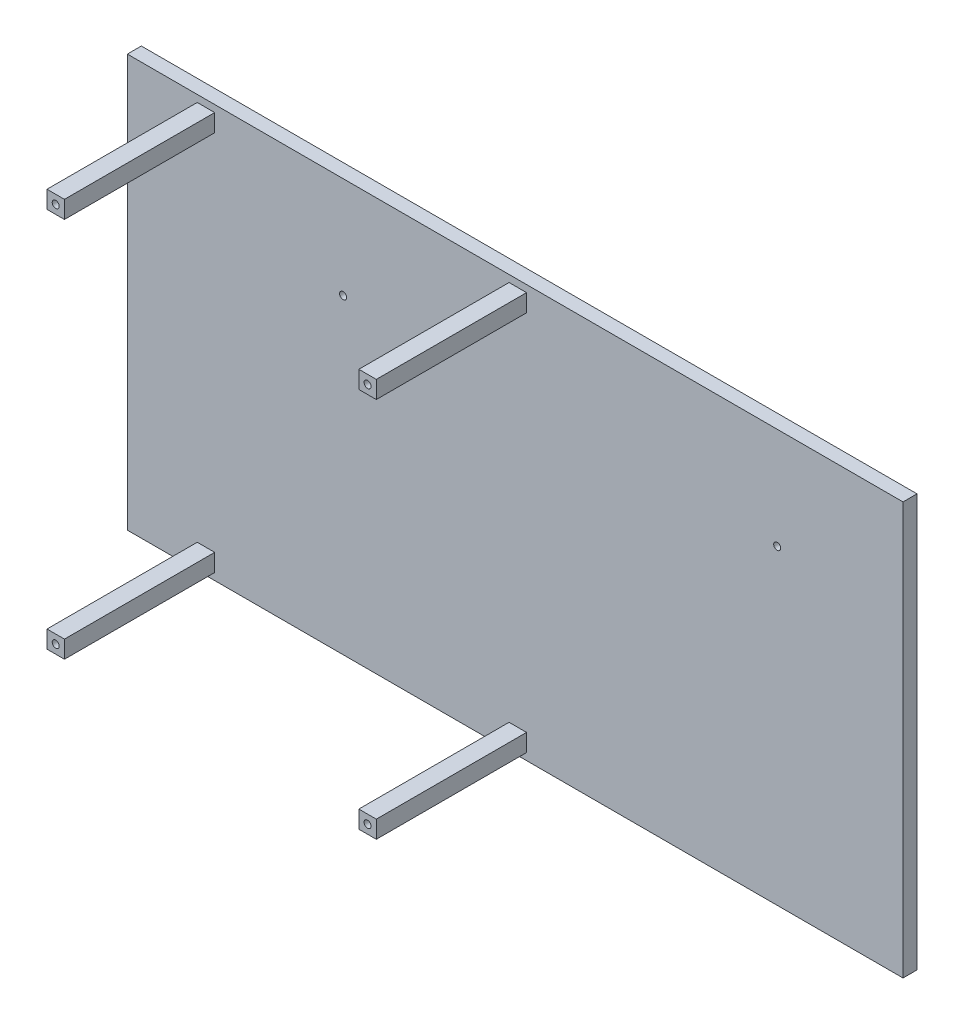
ISO-10303-21;
HEADER;
FILE_DESCRIPTION(('STEP AP214'),'2;1');
FILE_NAME('part.step','',(''),(''),'','','');
FILE_SCHEMA(('AUTOMOTIVE_DESIGN { 1 0 10303 214 1 1 1 1 }'));
ENDSEC;
DATA;
#1=APPLICATION_CONTEXT('core data for automotive mechanical design processes');
#2=APPLICATION_PROTOCOL_DEFINITION('international standard','automotive_design',2000,#1);
#3=PRODUCT_CONTEXT('',#1,'mechanical');
#4=PRODUCT('Part','Part','',(#3));
#5=PRODUCT_RELATED_PRODUCT_CATEGORY('part','',(#4));
#6=PRODUCT_DEFINITION_FORMATION('','',#4);
#7=PRODUCT_DEFINITION_CONTEXT('part definition',#1,'design');
#8=PRODUCT_DEFINITION('design','',#6,#7);
#9=PRODUCT_DEFINITION_SHAPE('','',#8);
#10=(LENGTH_UNIT() NAMED_UNIT(*) SI_UNIT(.MILLI.,.METRE.));
#11=(NAMED_UNIT(*) PLANE_ANGLE_UNIT() SI_UNIT($,.RADIAN.));
#12=(NAMED_UNIT(*) SI_UNIT($,.STERADIAN.) SOLID_ANGLE_UNIT());
#13=UNCERTAINTY_MEASURE_WITH_UNIT(LENGTH_MEASURE(1.E-05),#10,'distance_accuracy_value','');
#14=(GEOMETRIC_REPRESENTATION_CONTEXT(3) GLOBAL_UNCERTAINTY_ASSIGNED_CONTEXT((#13)) GLOBAL_UNIT_ASSIGNED_CONTEXT((#10,
#11,#12)) REPRESENTATION_CONTEXT('',''));
#15=CARTESIAN_POINT('',(0.,0.,0.));
#16=DIRECTION('',(0.,0.,1.));
#17=DIRECTION('',(1.,0.,0.));
#18=AXIS2_PLACEMENT_3D('',#15,#16,#17);
#19=CARTESIAN_POINT('',(0.,0.,4.));
#20=DIRECTION('',(0.,0.,1.));
#21=DIRECTION('',(1.,0.,0.));
#22=AXIS2_PLACEMENT_3D('',#19,#20,#21);
#23=PLANE('',#22);
#24=DIRECTION('',(-1.,0.,0.));
#25=VECTOR('',#24,1.);
#26=CARTESIAN_POINT('',(-69.7767857142857,-104.441964285714,4.));
#27=LINE('',#26,#25);
#28=CARTESIAN_POINT('',(150.223214285714,-104.441964285714,4.));
#29=VERTEX_POINT('',#28);
#30=CARTESIAN_POINT('',(-71.7767857142857,-104.441964285714,4.));
#31=VERTEX_POINT('',#30);
#32=EDGE_CURVE('E326',#29,#31,#27,.T.);
#33=ORIENTED_EDGE('',*,*,#32,.F.);
#34=DIRECTION('',(0.,-1.,0.));
#35=VECTOR('',#34,1.);
#36=CARTESIAN_POINT('',(150.223214285714,38.0580357142857,4.));
#37=LINE('',#36,#35);
#38=CARTESIAN_POINT('',(150.223214285714,13.5580357142857,4.));
#39=VERTEX_POINT('',#38);
#40=EDGE_CURVE('E390',#39,#29,#37,.T.);
#41=ORIENTED_EDGE('',*,*,#40,.F.);
#42=DIRECTION('',(1.,0.,0.));
#43=VECTOR('',#42,1.);
#44=CARTESIAN_POINT('',(-69.7767857142857,13.5580357142857,4.));
#45=LINE('',#44,#43);
#46=CARTESIAN_POINT('',(-71.7767857142857,13.5580357142857,4.));
#47=VERTEX_POINT('',#46);
#48=EDGE_CURVE('E333',#47,#39,#45,.T.);
#49=ORIENTED_EDGE('',*,*,#48,.F.);
#50=DIRECTION('',(0.,-1.,0.));
#51=VECTOR('',#50,1.);
#52=CARTESIAN_POINT('',(-71.7767857142857,13.5580357142857,4.));
#53=LINE('',#52,#51);
#54=EDGE_CURVE('E262',#47,#31,#53,.T.);
#55=ORIENTED_EDGE('',*,*,#54,.T.);
#56=EDGE_LOOP('',(#33,#41,#49,#55));
#57=FACE_BOUND('',#56,.T.);
#58=CARTESIAN_POINT('',(-10.0267857142857,-15.4419642857143,4.));
#59=DIRECTION('',(0.,0.,1.));
#60=DIRECTION('',(1.,0.,0.));
#61=AXIS2_PLACEMENT_3D('',#58,#59,#60);
#62=CIRCLE('',#61,0.999999999999998);
#63=CARTESIAN_POINT('',(-9.02678571428567,-15.4419642857143,4.));
#64=VERTEX_POINT('',#63);
#65=EDGE_CURVE('E395',#64,#64,#62,.T.);
#66=ORIENTED_EDGE('',*,*,#65,.F.);
#67=EDGE_LOOP('',(#66));
#68=FACE_BOUND('',#67,.T.);
#69=CARTESIAN_POINT('',(114.203214285714,-15.4419642857143,4.));
#70=DIRECTION('',(0.,0.,1.));
#71=DIRECTION('',(1.,0.,0.));
#72=AXIS2_PLACEMENT_3D('',#69,#70,#71);
#73=CIRCLE('',#72,0.999999999999998);
#74=CARTESIAN_POINT('',(115.203214285714,-15.4419642857143,4.));
#75=VERTEX_POINT('',#74);
#76=EDGE_CURVE('E391',#75,#75,#73,.T.);
#77=ORIENTED_EDGE('',*,*,#76,.F.);
#78=EDGE_LOOP('',(#77));
#79=FACE_BOUND('',#78,.T.);
#80=DIRECTION('',(-1.,0.,0.));
#81=VECTOR('',#80,1.);
#82=CARTESIAN_POINT('',(37.4732142857143,11.5580357142857,4.));
#83=LINE('',#82,#81);
#84=CARTESIAN_POINT('',(42.4732142857143,11.5580357142857,4.));
#85=VERTEX_POINT('',#84);
#86=CARTESIAN_POINT('',(37.4732142857143,11.5580357142857,4.));
#87=VERTEX_POINT('',#86);
#88=EDGE_CURVE('E363',#85,#87,#83,.T.);
#89=ORIENTED_EDGE('',*,*,#88,.F.);
#90=DIRECTION('',(0.,1.,0.));
#91=VECTOR('',#90,1.);
#92=CARTESIAN_POINT('',(42.4732142857143,11.5580357142857,4.));
#93=LINE('',#92,#91);
#94=CARTESIAN_POINT('',(42.4732142857143,6.55803571428572,4.));
#95=VERTEX_POINT('',#94);
#96=EDGE_CURVE('E344',#95,#85,#93,.T.);
#97=ORIENTED_EDGE('',*,*,#96,.F.);
#98=DIRECTION('',(1.,0.,0.));
#99=VECTOR('',#98,1.);
#100=CARTESIAN_POINT('',(37.4732142857143,6.55803571428572,4.));
#101=LINE('',#100,#99);
#102=CARTESIAN_POINT('',(37.4732142857143,6.55803571428572,4.));
#103=VERTEX_POINT('',#102);
#104=EDGE_CURVE('E350',#103,#95,#101,.T.);
#105=ORIENTED_EDGE('',*,*,#104,.F.);
#106=DIRECTION('',(0.,-1.,0.));
#107=VECTOR('',#106,1.);
#108=CARTESIAN_POINT('',(37.4732142857143,11.5580357142857,4.));
#109=LINE('',#108,#107);
#110=EDGE_CURVE('E366',#87,#103,#109,.T.);
#111=ORIENTED_EDGE('',*,*,#110,.F.);
#112=EDGE_LOOP('',(#89,#97,#105,#111));
#113=FACE_BOUND('',#112,.T.);
#114=DIRECTION('',(-1.,0.,0.));
#115=VECTOR('',#114,1.);
#116=CARTESIAN_POINT('',(42.4732142857143,-97.4419642857143,4.));
#117=LINE('',#116,#115);
#118=CARTESIAN_POINT('',(42.4732142857143,-97.4419642857143,4.));
#119=VERTEX_POINT('',#118);
#120=CARTESIAN_POINT('',(37.4732142857143,-97.4419642857143,4.));
#121=VERTEX_POINT('',#120);
#122=EDGE_CURVE('E301',#119,#121,#117,.T.);
#123=ORIENTED_EDGE('',*,*,#122,.F.);
#124=DIRECTION('',(0.,1.,0.));
#125=VECTOR('',#124,1.);
#126=CARTESIAN_POINT('',(42.4732142857143,-102.441964285714,4.));
#127=LINE('',#126,#125);
#128=CARTESIAN_POINT('',(42.4732142857143,-102.441964285714,4.));
#129=VERTEX_POINT('',#128);
#130=EDGE_CURVE('E279',#129,#119,#127,.T.);
#131=ORIENTED_EDGE('',*,*,#130,.F.);
#132=DIRECTION('',(1.,0.,0.));
#133=VECTOR('',#132,1.);
#134=CARTESIAN_POINT('',(42.4732142857143,-102.441964285714,4.));
#135=LINE('',#134,#133);
#136=CARTESIAN_POINT('',(37.4732142857143,-102.441964285714,4.));
#137=VERTEX_POINT('',#136);
#138=EDGE_CURVE('E288',#137,#129,#135,.T.);
#139=ORIENTED_EDGE('',*,*,#138,.F.);
#140=DIRECTION('',(0.,-1.,0.));
#141=VECTOR('',#140,1.);
#142=CARTESIAN_POINT('',(37.4732142857143,-102.441964285714,4.));
#143=LINE('',#142,#141);
#144=EDGE_CURVE('E304',#121,#137,#143,.T.);
#145=ORIENTED_EDGE('',*,*,#144,.F.);
#146=EDGE_LOOP('',(#123,#131,#139,#145));
#147=FACE_BOUND('',#146,.T.);
#148=DIRECTION('',(1.,0.,0.));
#149=VECTOR('',#148,1.);
#150=CARTESIAN_POINT('',(-46.7767857142857,6.55803571428572,4.));
#151=LINE('',#150,#149);
#152=CARTESIAN_POINT('',(-51.7767857142857,6.55803571428572,4.));
#153=VERTEX_POINT('',#152);
#154=CARTESIAN_POINT('',(-46.7767857142857,6.55803571428572,4.));
#155=VERTEX_POINT('',#154);
#156=EDGE_CURVE('E213',#153,#155,#151,.T.);
#157=ORIENTED_EDGE('',*,*,#156,.F.);
#158=DIRECTION('',(0.,-1.,0.));
#159=VECTOR('',#158,1.);
#160=CARTESIAN_POINT('',(-51.7767857142857,11.5580357142857,4.));
#161=LINE('',#160,#159);
#162=CARTESIAN_POINT('',(-51.7767857142857,11.5580357142857,4.));
#163=VERTEX_POINT('',#162);
#164=EDGE_CURVE('E208',#163,#153,#161,.T.);
#165=ORIENTED_EDGE('',*,*,#164,.F.);
#166=DIRECTION('',(-1.,0.,0.));
#167=VECTOR('',#166,1.);
#168=CARTESIAN_POINT('',(-46.7767857142857,11.5580357142857,4.));
#169=LINE('',#168,#167);
#170=CARTESIAN_POINT('',(-46.7767857142857,11.5580357142857,4.));
#171=VERTEX_POINT('',#170);
#172=EDGE_CURVE('E233',#171,#163,#169,.T.);
#173=ORIENTED_EDGE('',*,*,#172,.F.);
#174=DIRECTION('',(0.,1.,0.));
#175=VECTOR('',#174,1.);
#176=CARTESIAN_POINT('',(-46.7767857142857,11.5580357142857,4.));
#177=LINE('',#176,#175);
#178=EDGE_CURVE('E245',#155,#171,#177,.T.);
#179=ORIENTED_EDGE('',*,*,#178,.F.);
#180=EDGE_LOOP('',(#157,#165,#173,#179));
#181=FACE_BOUND('',#180,.T.);
#182=DIRECTION('',(1.,0.,0.));
#183=VECTOR('',#182,1.);
#184=CARTESIAN_POINT('',(-51.7767857142857,-102.441964285714,4.));
#185=LINE('',#184,#183);
#186=CARTESIAN_POINT('',(-51.7767857142857,-102.441964285714,4.));
#187=VERTEX_POINT('',#186);
#188=CARTESIAN_POINT('',(-46.7767857142857,-102.441964285714,4.));
#189=VERTEX_POINT('',#188);
#190=EDGE_CURVE('E206',#187,#189,#185,.T.);
#191=ORIENTED_EDGE('',*,*,#190,.F.);
#192=DIRECTION('',(0.,-1.,0.));
#193=VECTOR('',#192,1.);
#194=CARTESIAN_POINT('',(-51.7767857142857,-97.4419642857143,4.));
#195=LINE('',#194,#193);
#196=CARTESIAN_POINT('',(-51.7767857142857,-97.4419642857143,4.));
#197=VERTEX_POINT('',#196);
#198=EDGE_CURVE('E200',#197,#187,#195,.T.);
#199=ORIENTED_EDGE('',*,*,#198,.F.);
#200=DIRECTION('',(-1.,0.,0.));
#201=VECTOR('',#200,1.);
#202=CARTESIAN_POINT('',(-51.7767857142857,-97.4419642857143,4.));
#203=LINE('',#202,#201);
#204=CARTESIAN_POINT('',(-46.7767857142857,-97.4419642857143,4.));
#205=VERTEX_POINT('',#204);
#206=EDGE_CURVE('E184',#205,#197,#203,.T.);
#207=ORIENTED_EDGE('',*,*,#206,.F.);
#208=DIRECTION('',(0.,1.,0.));
#209=VECTOR('',#208,1.);
#210=CARTESIAN_POINT('',(-46.7767857142857,-97.4419642857143,4.));
#211=LINE('',#210,#209);
#212=EDGE_CURVE('E193',#189,#205,#211,.T.);
#213=ORIENTED_EDGE('',*,*,#212,.F.);
#214=EDGE_LOOP('',(#191,#199,#207,#213));
#215=FACE_BOUND('',#214,.T.);
#216=ADVANCED_FACE('F45',(#57,#68,#79,#113,#147,#181,#215),#23,.T.);
#217=CARTESIAN_POINT('',(-69.7767857142857,-104.441964285714,0.));
#218=DIRECTION('',(0.,-1.,0.));
#219=DIRECTION('',(0.,0.,-1.));
#220=AXIS2_PLACEMENT_3D('',#217,#218,#219);
#221=PLANE('',#220);
#222=ORIENTED_EDGE('',*,*,#32,.T.);
#223=DIRECTION('',(0.,0.,1.));
#224=VECTOR('',#223,1.);
#225=CARTESIAN_POINT('',(-71.7767857142857,-104.441964285714,0.));
#226=LINE('',#225,#224);
#227=CARTESIAN_POINT('',(-71.7767857142857,-104.441964285714,0.));
#228=VERTEX_POINT('',#227);
#229=EDGE_CURVE('E11',#228,#31,#226,.T.);
#230=ORIENTED_EDGE('',*,*,#229,.F.);
#231=DIRECTION('',(1.,0.,0.));
#232=VECTOR('',#231,1.);
#233=CARTESIAN_POINT('',(-69.7767857142857,-104.441964285714,0.));
#234=LINE('',#233,#232);
#235=CARTESIAN_POINT('',(150.223214285714,-104.441964285714,0.));
#236=VERTEX_POINT('',#235);
#237=EDGE_CURVE('E54',#228,#236,#234,.T.);
#238=ORIENTED_EDGE('',*,*,#237,.T.);
#239=DIRECTION('',(0.,0.,1.));
#240=VECTOR('',#239,1.);
#241=CARTESIAN_POINT('',(150.223214285714,-104.441964285714,-6.));
#242=LINE('',#241,#240);
#243=EDGE_CURVE('E329',#236,#29,#242,.T.);
#244=ORIENTED_EDGE('',*,*,#243,.T.);
#245=EDGE_LOOP('',(#222,#230,#238,#244));
#246=FACE_BOUND('',#245,.T.);
#247=ADVANCED_FACE('F414',(#246),#221,.T.);
#248=CARTESIAN_POINT('',(-71.7767857142857,-104.441964285714,0.));
#249=DIRECTION('',(-1.,0.,0.));
#250=DIRECTION('',(0.,0.,1.));
#251=AXIS2_PLACEMENT_3D('',#248,#249,#250);
#252=PLANE('',#251);
#253=ORIENTED_EDGE('',*,*,#229,.T.);
#254=ORIENTED_EDGE('',*,*,#54,.F.);
#255=DIRECTION('',(0.,0.,-1.));
#256=VECTOR('',#255,1.);
#257=CARTESIAN_POINT('',(-71.7767857142857,13.5580357142857,47.));
#258=LINE('',#257,#256);
#259=CARTESIAN_POINT('',(-71.7767857142857,13.5580357142857,0.));
#260=VERTEX_POINT('',#259);
#261=EDGE_CURVE('E323',#47,#260,#258,.T.);
#262=ORIENTED_EDGE('',*,*,#261,.T.);
#263=DIRECTION('',(0.,-1.,0.));
#264=VECTOR('',#263,1.);
#265=CARTESIAN_POINT('',(-71.7767857142857,-104.441964285714,0.));
#266=LINE('',#265,#264);
#267=EDGE_CURVE('E407',#260,#228,#266,.T.);
#268=ORIENTED_EDGE('',*,*,#267,.T.);
#269=EDGE_LOOP('',(#253,#254,#262,#268));
#270=FACE_BOUND('',#269,.T.);
#271=ADVANCED_FACE('F47',(#270),#252,.T.);
#272=CARTESIAN_POINT('',(-69.7767857142857,13.5580357142857,-6.));
#273=DIRECTION('',(0.,-1.,0.));
#274=DIRECTION('',(0.,0.,-1.));
#275=AXIS2_PLACEMENT_3D('',#272,#273,#274);
#276=PLANE('',#275);
#277=ORIENTED_EDGE('',*,*,#261,.F.);
#278=ORIENTED_EDGE('',*,*,#48,.T.);
#279=DIRECTION('',(0.,0.,1.));
#280=VECTOR('',#279,1.);
#281=CARTESIAN_POINT('',(150.223214285714,13.5580357142857,-6.));
#282=LINE('',#281,#280);
#283=CARTESIAN_POINT('',(150.223214285714,13.5580357142857,0.));
#284=VERTEX_POINT('',#283);
#285=EDGE_CURVE('E336',#284,#39,#282,.T.);
#286=ORIENTED_EDGE('',*,*,#285,.F.);
#287=DIRECTION('',(1.,0.,0.));
#288=VECTOR('',#287,1.);
#289=CARTESIAN_POINT('',(0.,13.5580357142857,0.));
#290=LINE('',#289,#288);
#291=EDGE_CURVE('E340',#260,#284,#290,.T.);
#292=ORIENTED_EDGE('',*,*,#291,.F.);
#293=EDGE_LOOP('',(#277,#278,#286,#292));
#294=FACE_BOUND('',#293,.T.);
#295=ADVANCED_FACE('F428',(#294),#276,.F.);
#296=CARTESIAN_POINT('',(0.,0.,0.));
#297=DIRECTION('',(0.,0.,1.));
#298=DIRECTION('',(1.,0.,0.));
#299=AXIS2_PLACEMENT_3D('',#296,#297,#298);
#300=PLANE('',#299);
#301=ORIENTED_EDGE('',*,*,#291,.T.);
#302=DIRECTION('',(0.,1.,0.));
#303=VECTOR('',#302,1.);
#304=CARTESIAN_POINT('',(150.223214285714,38.0580357142857,0.));
#305=LINE('',#304,#303);
#306=EDGE_CURVE('E404',#236,#284,#305,.T.);
#307=ORIENTED_EDGE('',*,*,#306,.F.);
#308=ORIENTED_EDGE('',*,*,#237,.F.);
#309=ORIENTED_EDGE('',*,*,#267,.F.);
#310=EDGE_LOOP('',(#301,#307,#308,#309));
#311=FACE_BOUND('',#310,.T.);
#312=CARTESIAN_POINT('',(114.203214285714,-15.4419642857143,0.));
#313=DIRECTION('',(0.,0.,1.));
#314=DIRECTION('',(1.,0.,0.));
#315=AXIS2_PLACEMENT_3D('',#312,#313,#314);
#316=CIRCLE('',#315,0.999999999999998);
#317=CARTESIAN_POINT('',(115.203214285714,-15.4419642857143,0.));
#318=VERTEX_POINT('',#317);
#319=EDGE_CURVE('E386',#318,#318,#316,.T.);
#320=ORIENTED_EDGE('',*,*,#319,.T.);
#321=EDGE_LOOP('',(#320));
#322=FACE_BOUND('',#321,.T.);
#323=CARTESIAN_POINT('',(-10.0267857142857,-15.4419642857143,0.));
#324=DIRECTION('',(0.,0.,1.));
#325=DIRECTION('',(1.,0.,0.));
#326=AXIS2_PLACEMENT_3D('',#323,#324,#325);
#327=CIRCLE('',#326,0.999999999999998);
#328=CARTESIAN_POINT('',(-9.02678571428567,-15.4419642857143,0.));
#329=VERTEX_POINT('',#328);
#330=EDGE_CURVE('E385',#329,#329,#327,.T.);
#331=ORIENTED_EDGE('',*,*,#330,.T.);
#332=EDGE_LOOP('',(#331));
#333=FACE_BOUND('',#332,.T.);
#334=ADVANCED_FACE('F423',(#311,#322,#333),#300,.F.);
#335=CARTESIAN_POINT('',(0.,0.,47.));
#336=DIRECTION('',(0.,0.,1.));
#337=DIRECTION('',(1.,0.,0.));
#338=AXIS2_PLACEMENT_3D('',#335,#336,#337);
#339=PLANE('',#338);
#340=CARTESIAN_POINT('',(39.9732142857143,-99.9419642857143,47.));
#341=DIRECTION('',(0.,0.,1.));
#342=DIRECTION('',(1.,0.,0.));
#343=AXIS2_PLACEMENT_3D('',#340,#341,#342);
#344=CIRCLE('',#343,0.999999999999998);
#345=CARTESIAN_POINT('',(40.9732142857143,-99.9419642857143,47.));
#346=VERTEX_POINT('',#345);
#347=EDGE_CURVE('E267',#346,#346,#344,.T.);
#348=ORIENTED_EDGE('',*,*,#347,.F.);
#349=EDGE_LOOP('',(#348));
#350=FACE_BOUND('',#349,.T.);
#351=DIRECTION('',(0.,1.,0.));
#352=VECTOR('',#351,1.);
#353=CARTESIAN_POINT('',(42.4732142857143,-102.441964285714,47.));
#354=LINE('',#353,#352);
#355=CARTESIAN_POINT('',(42.4732142857143,-102.441964285714,47.));
#356=VERTEX_POINT('',#355);
#357=CARTESIAN_POINT('',(42.4732142857143,-97.4419642857143,47.));
#358=VERTEX_POINT('',#357);
#359=EDGE_CURVE('E283',#356,#358,#354,.T.);
#360=ORIENTED_EDGE('',*,*,#359,.T.);
#361=DIRECTION('',(-1.,0.,0.));
#362=VECTOR('',#361,1.);
#363=CARTESIAN_POINT('',(42.4732142857143,-97.4419642857143,47.));
#364=LINE('',#363,#362);
#365=CARTESIAN_POINT('',(37.4732142857143,-97.4419642857143,47.));
#366=VERTEX_POINT('',#365);
#367=EDGE_CURVE('E287',#358,#366,#364,.T.);
#368=ORIENTED_EDGE('',*,*,#367,.T.);
#369=DIRECTION('',(0.,-1.,0.));
#370=VECTOR('',#369,1.);
#371=CARTESIAN_POINT('',(37.4732142857143,-102.441964285714,47.));
#372=LINE('',#371,#370);
#373=CARTESIAN_POINT('',(37.4732142857143,-102.441964285714,47.));
#374=VERTEX_POINT('',#373);
#375=EDGE_CURVE('E291',#366,#374,#372,.T.);
#376=ORIENTED_EDGE('',*,*,#375,.T.);
#377=DIRECTION('',(1.,0.,0.));
#378=VECTOR('',#377,1.);
#379=CARTESIAN_POINT('',(42.4732142857143,-102.441964285714,47.));
#380=LINE('',#379,#378);
#381=EDGE_CURVE('E294',#374,#356,#380,.T.);
#382=ORIENTED_EDGE('',*,*,#381,.T.);
#383=EDGE_LOOP('',(#360,#368,#376,#382));
#384=FACE_BOUND('',#383,.T.);
#385=ADVANCED_FACE('F448',(#350,#384),#339,.T.);
#386=CARTESIAN_POINT('',(42.4732142857143,-102.441964285714,47.));
#387=DIRECTION('',(0.,1.,0.));
#388=DIRECTION('',(0.,0.,1.));
#389=AXIS2_PLACEMENT_3D('',#386,#387,#388);
#390=PLANE('',#389);
#391=ORIENTED_EDGE('',*,*,#138,.T.);
#392=DIRECTION('',(0.,0.,-1.));
#393=VECTOR('',#392,1.);
#394=CARTESIAN_POINT('',(42.4732142857143,-102.441964285714,47.));
#395=LINE('',#394,#393);
#396=EDGE_CURVE('E297',#356,#129,#395,.T.);
#397=ORIENTED_EDGE('',*,*,#396,.F.);
#398=ORIENTED_EDGE('',*,*,#381,.F.);
#399=DIRECTION('',(0.,0.,-1.));
#400=VECTOR('',#399,1.);
#401=CARTESIAN_POINT('',(37.4732142857143,-102.441964285714,47.));
#402=LINE('',#401,#400);
#403=EDGE_CURVE('E313',#374,#137,#402,.T.);
#404=ORIENTED_EDGE('',*,*,#403,.T.);
#405=EDGE_LOOP('',(#391,#397,#398,#404));
#406=FACE_BOUND('',#405,.T.);
#407=ADVANCED_FACE('F452',(#406),#390,.F.);
#408=CARTESIAN_POINT('',(37.4732142857143,-102.441964285714,47.));
#409=DIRECTION('',(1.,0.,0.));
#410=DIRECTION('',(0.,0.,-1.));
#411=AXIS2_PLACEMENT_3D('',#408,#409,#410);
#412=PLANE('',#411);
#413=ORIENTED_EDGE('',*,*,#144,.T.);
#414=ORIENTED_EDGE('',*,*,#403,.F.);
#415=ORIENTED_EDGE('',*,*,#375,.F.);
#416=DIRECTION('',(0.,0.,-1.));
#417=VECTOR('',#416,1.);
#418=CARTESIAN_POINT('',(37.4732142857143,-97.4419642857143,47.));
#419=LINE('',#418,#417);
#420=EDGE_CURVE('E316',#366,#121,#419,.T.);
#421=ORIENTED_EDGE('',*,*,#420,.T.);
#422=EDGE_LOOP('',(#413,#414,#415,#421));
#423=FACE_BOUND('',#422,.T.);
#424=ADVANCED_FACE('F458',(#423),#412,.F.);
#425=CARTESIAN_POINT('',(42.4732142857143,-97.4419642857143,47.));
#426=DIRECTION('',(0.,-1.,0.));
#427=DIRECTION('',(0.,0.,-1.));
#428=AXIS2_PLACEMENT_3D('',#425,#426,#427);
#429=PLANE('',#428);
#430=ORIENTED_EDGE('',*,*,#122,.T.);
#431=ORIENTED_EDGE('',*,*,#420,.F.);
#432=ORIENTED_EDGE('',*,*,#367,.F.);
#433=DIRECTION('',(0.,0.,-1.));
#434=VECTOR('',#433,1.);
#435=CARTESIAN_POINT('',(42.4732142857143,-97.4419642857143,47.));
#436=LINE('',#435,#434);
#437=EDGE_CURVE('E320',#358,#119,#436,.T.);
#438=ORIENTED_EDGE('',*,*,#437,.T.);
#439=EDGE_LOOP('',(#430,#431,#432,#438));
#440=FACE_BOUND('',#439,.T.);
#441=ADVANCED_FACE('F469',(#440),#429,.F.);
#442=CARTESIAN_POINT('',(42.4732142857143,-102.441964285714,47.));
#443=DIRECTION('',(-1.,0.,0.));
#444=DIRECTION('',(0.,0.,1.));
#445=AXIS2_PLACEMENT_3D('',#442,#443,#444);
#446=PLANE('',#445);
#447=ORIENTED_EDGE('',*,*,#130,.T.);
#448=ORIENTED_EDGE('',*,*,#437,.F.);
#449=ORIENTED_EDGE('',*,*,#359,.F.);
#450=ORIENTED_EDGE('',*,*,#396,.T.);
#451=EDGE_LOOP('',(#447,#448,#449,#450));
#452=FACE_BOUND('',#451,.T.);
#453=ADVANCED_FACE('F473',(#452),#446,.F.);
#454=CARTESIAN_POINT('',(0.,0.,47.));
#455=DIRECTION('',(0.,0.,1.));
#456=DIRECTION('',(1.,0.,0.));
#457=AXIS2_PLACEMENT_3D('',#454,#455,#456);
#458=PLANE('',#457);
#459=CARTESIAN_POINT('',(39.9732142857143,9.05803571428572,47.));
#460=DIRECTION('',(0.,0.,1.));
#461=DIRECTION('',(1.,0.,0.));
#462=AXIS2_PLACEMENT_3D('',#459,#460,#461);
#463=CIRCLE('',#462,0.999999999999998);
#464=CARTESIAN_POINT('',(40.9732142857143,9.05803571428572,47.));
#465=VERTEX_POINT('',#464);
#466=EDGE_CURVE('E271',#465,#465,#463,.T.);
#467=ORIENTED_EDGE('',*,*,#466,.F.);
#468=EDGE_LOOP('',(#467));
#469=FACE_BOUND('',#468,.T.);
#470=DIRECTION('',(0.,1.,0.));
#471=VECTOR('',#470,1.);
#472=CARTESIAN_POINT('',(42.4732142857143,11.5580357142857,47.));
#473=LINE('',#472,#471);
#474=CARTESIAN_POINT('',(42.4732142857143,6.55803571428572,47.));
#475=VERTEX_POINT('',#474);
#476=CARTESIAN_POINT('',(42.4732142857143,11.5580357142857,47.));
#477=VERTEX_POINT('',#476);
#478=EDGE_CURVE('E345',#475,#477,#473,.T.);
#479=ORIENTED_EDGE('',*,*,#478,.T.);
#480=DIRECTION('',(-1.,0.,0.));
#481=VECTOR('',#480,1.);
#482=CARTESIAN_POINT('',(37.4732142857143,11.5580357142857,47.));
#483=LINE('',#482,#481);
#484=CARTESIAN_POINT('',(37.4732142857143,11.5580357142857,47.));
#485=VERTEX_POINT('',#484);
#486=EDGE_CURVE('E349',#477,#485,#483,.T.);
#487=ORIENTED_EDGE('',*,*,#486,.T.);
#488=DIRECTION('',(0.,-1.,0.));
#489=VECTOR('',#488,1.);
#490=CARTESIAN_POINT('',(37.4732142857143,11.5580357142857,47.));
#491=LINE('',#490,#489);
#492=CARTESIAN_POINT('',(37.4732142857143,6.55803571428572,47.));
#493=VERTEX_POINT('',#492);
#494=EDGE_CURVE('E353',#485,#493,#491,.T.);
#495=ORIENTED_EDGE('',*,*,#494,.T.);
#496=DIRECTION('',(1.,0.,0.));
#497=VECTOR('',#496,1.);
#498=CARTESIAN_POINT('',(37.4732142857143,6.55803571428572,47.));
#499=LINE('',#498,#497);
#500=EDGE_CURVE('E356',#493,#475,#499,.T.);
#501=ORIENTED_EDGE('',*,*,#500,.T.);
#502=EDGE_LOOP('',(#479,#487,#495,#501));
#503=FACE_BOUND('',#502,.T.);
#504=ADVANCED_FACE('F476',(#469,#503),#458,.T.);
#505=CARTESIAN_POINT('',(37.4732142857143,6.55803571428572,47.));
#506=DIRECTION('',(0.,1.,0.));
#507=DIRECTION('',(0.,0.,1.));
#508=AXIS2_PLACEMENT_3D('',#505,#506,#507);
#509=PLANE('',#508);
#510=ORIENTED_EDGE('',*,*,#104,.T.);
#511=DIRECTION('',(0.,0.,-1.));
#512=VECTOR('',#511,1.);
#513=CARTESIAN_POINT('',(42.4732142857143,6.55803571428572,47.));
#514=LINE('',#513,#512);
#515=EDGE_CURVE('E359',#475,#95,#514,.T.);
#516=ORIENTED_EDGE('',*,*,#515,.F.);
#517=ORIENTED_EDGE('',*,*,#500,.F.);
#518=DIRECTION('',(0.,0.,-1.));
#519=VECTOR('',#518,1.);
#520=CARTESIAN_POINT('',(37.4732142857143,6.55803571428572,47.));
#521=LINE('',#520,#519);
#522=EDGE_CURVE('E375',#493,#103,#521,.T.);
#523=ORIENTED_EDGE('',*,*,#522,.T.);
#524=EDGE_LOOP('',(#510,#516,#517,#523));
#525=FACE_BOUND('',#524,.T.);
#526=ADVANCED_FACE('F481',(#525),#509,.F.);
#527=CARTESIAN_POINT('',(37.4732142857143,11.5580357142857,47.));
#528=DIRECTION('',(1.,0.,0.));
#529=DIRECTION('',(0.,0.,-1.));
#530=AXIS2_PLACEMENT_3D('',#527,#528,#529);
#531=PLANE('',#530);
#532=ORIENTED_EDGE('',*,*,#110,.T.);
#533=ORIENTED_EDGE('',*,*,#522,.F.);
#534=ORIENTED_EDGE('',*,*,#494,.F.);
#535=DIRECTION('',(0.,0.,-1.));
#536=VECTOR('',#535,1.);
#537=CARTESIAN_POINT('',(37.4732142857143,11.5580357142857,47.));
#538=LINE('',#537,#536);
#539=EDGE_CURVE('E378',#485,#87,#538,.T.);
#540=ORIENTED_EDGE('',*,*,#539,.T.);
#541=EDGE_LOOP('',(#532,#533,#534,#540));
#542=FACE_BOUND('',#541,.T.);
#543=ADVANCED_FACE('F485',(#542),#531,.F.);
#544=CARTESIAN_POINT('',(37.4732142857143,11.5580357142857,47.));
#545=DIRECTION('',(0.,-1.,0.));
#546=DIRECTION('',(0.,0.,-1.));
#547=AXIS2_PLACEMENT_3D('',#544,#545,#546);
#548=PLANE('',#547);
#549=ORIENTED_EDGE('',*,*,#88,.T.);
#550=ORIENTED_EDGE('',*,*,#539,.F.);
#551=ORIENTED_EDGE('',*,*,#486,.F.);
#552=DIRECTION('',(0.,0.,-1.));
#553=VECTOR('',#552,1.);
#554=CARTESIAN_POINT('',(42.4732142857143,11.5580357142857,47.));
#555=LINE('',#554,#553);
#556=EDGE_CURVE('E382',#477,#85,#555,.T.);
#557=ORIENTED_EDGE('',*,*,#556,.T.);
#558=EDGE_LOOP('',(#549,#550,#551,#557));
#559=FACE_BOUND('',#558,.T.);
#560=ADVANCED_FACE('F489',(#559),#548,.F.);
#561=CARTESIAN_POINT('',(42.4732142857143,11.5580357142857,47.));
#562=DIRECTION('',(-1.,0.,0.));
#563=DIRECTION('',(0.,-1.,0.));
#564=AXIS2_PLACEMENT_3D('',#561,#562,#563);
#565=PLANE('',#564);
#566=ORIENTED_EDGE('',*,*,#96,.T.);
#567=ORIENTED_EDGE('',*,*,#556,.F.);
#568=ORIENTED_EDGE('',*,*,#478,.F.);
#569=ORIENTED_EDGE('',*,*,#515,.T.);
#570=EDGE_LOOP('',(#566,#567,#568,#569));
#571=FACE_BOUND('',#570,.T.);
#572=ADVANCED_FACE('F493',(#571),#565,.F.);
#573=CARTESIAN_POINT('',(114.203214285714,-15.4419642857143,0.));
#574=DIRECTION('',(0.,0.,1.));
#575=DIRECTION('',(1.,0.,0.));
#576=AXIS2_PLACEMENT_3D('',#573,#574,#575);
#577=CYLINDRICAL_SURFACE('',#576,0.999999999999998);
#578=ORIENTED_EDGE('',*,*,#319,.F.);
#579=EDGE_LOOP('',(#578));
#580=FACE_BOUND('',#579,.T.);
#581=ORIENTED_EDGE('',*,*,#76,.T.);
#582=EDGE_LOOP('',(#581));
#583=FACE_BOUND('',#582,.T.);
#584=ADVANCED_FACE('F497',(#580,#583),#577,.F.);
#585=CARTESIAN_POINT('',(-10.0267857142857,-15.4419642857143,0.));
#586=DIRECTION('',(0.,0.,1.));
#587=DIRECTION('',(1.,0.,0.));
#588=AXIS2_PLACEMENT_3D('',#585,#586,#587);
#589=CYLINDRICAL_SURFACE('',#588,0.999999999999998);
#590=ORIENTED_EDGE('',*,*,#330,.F.);
#591=EDGE_LOOP('',(#590));
#592=FACE_BOUND('',#591,.T.);
#593=ORIENTED_EDGE('',*,*,#65,.T.);
#594=EDGE_LOOP('',(#593));
#595=FACE_BOUND('',#594,.T.);
#596=ADVANCED_FACE('F500',(#592,#595),#589,.F.);
#597=CARTESIAN_POINT('',(150.223214285714,0.,0.));
#598=DIRECTION('',(1.,0.,0.));
#599=DIRECTION('',(0.,1.,0.));
#600=AXIS2_PLACEMENT_3D('',#597,#598,#599);
#601=PLANE('',#600);
#602=ORIENTED_EDGE('',*,*,#40,.T.);
#603=ORIENTED_EDGE('',*,*,#243,.F.);
#604=ORIENTED_EDGE('',*,*,#306,.T.);
#605=ORIENTED_EDGE('',*,*,#285,.T.);
#606=EDGE_LOOP('',(#602,#603,#604,#605));
#607=FACE_BOUND('',#606,.T.);
#608=ADVANCED_FACE('F420',(#607),#601,.T.);
#609=CARTESIAN_POINT('',(39.9732142857143,9.05803571428572,44.));
#610=DIRECTION('',(0.,0.,1.));
#611=DIRECTION('',(1.,0.,0.));
#612=AXIS2_PLACEMENT_3D('',#609,#610,#611);
#613=CYLINDRICAL_SURFACE('',#612,0.999999999999998);
#614=CARTESIAN_POINT('',(39.9732142857143,9.05803571428572,44.));
#615=DIRECTION('',(0.,0.,1.));
#616=DIRECTION('',(1.,0.,0.));
#617=AXIS2_PLACEMENT_3D('',#614,#615,#616);
#618=CIRCLE('',#617,0.999999999999998);
#619=CARTESIAN_POINT('',(40.9732142857143,9.05803571428572,44.));
#620=VERTEX_POINT('',#619);
#621=EDGE_CURVE('E275',#620,#620,#618,.T.);
#622=ORIENTED_EDGE('',*,*,#621,.F.);
#623=EDGE_LOOP('',(#622));
#624=FACE_BOUND('',#623,.T.);
#625=ORIENTED_EDGE('',*,*,#466,.T.);
#626=EDGE_LOOP('',(#625));
#627=FACE_BOUND('',#626,.T.);
#628=ADVANCED_FACE('F464',(#624,#627),#613,.F.);
#629=CARTESIAN_POINT('',(39.9732142857143,9.05803571428572,44.));
#630=DIRECTION('',(0.,0.,1.));
#631=DIRECTION('',(1.,0.,0.));
#632=AXIS2_PLACEMENT_3D('',#629,#630,#631);
#633=PLANE('',#632);
#634=ORIENTED_EDGE('',*,*,#621,.T.);
#635=EDGE_LOOP('',(#634));
#636=FACE_BOUND('',#635,.T.);
#637=ADVANCED_FACE('F559',(#636),#633,.T.);
#638=CARTESIAN_POINT('',(39.9732142857143,-99.9419642857143,44.));
#639=DIRECTION('',(0.,0.,1.));
#640=DIRECTION('',(1.,0.,0.));
#641=AXIS2_PLACEMENT_3D('',#638,#639,#640);
#642=CYLINDRICAL_SURFACE('',#641,0.999999999999998);
#643=CARTESIAN_POINT('',(39.9732142857143,-99.9419642857143,44.));
#644=DIRECTION('',(0.,0.,1.));
#645=DIRECTION('',(1.,0.,0.));
#646=AXIS2_PLACEMENT_3D('',#643,#644,#645);
#647=CIRCLE('',#646,0.999999999999998);
#648=CARTESIAN_POINT('',(40.9732142857143,-99.9419642857143,44.));
#649=VERTEX_POINT('',#648);
#650=EDGE_CURVE('E266',#649,#649,#647,.T.);
#651=ORIENTED_EDGE('',*,*,#650,.F.);
#652=EDGE_LOOP('',(#651));
#653=FACE_BOUND('',#652,.T.);
#654=ORIENTED_EDGE('',*,*,#347,.T.);
#655=EDGE_LOOP('',(#654));
#656=FACE_BOUND('',#655,.T.);
#657=ADVANCED_FACE('F556',(#653,#656),#642,.F.);
#658=CARTESIAN_POINT('',(39.9732142857143,-99.9419642857143,44.));
#659=DIRECTION('',(0.,0.,1.));
#660=DIRECTION('',(1.,0.,0.));
#661=AXIS2_PLACEMENT_3D('',#658,#659,#660);
#662=PLANE('',#661);
#663=ORIENTED_EDGE('',*,*,#650,.T.);
#664=EDGE_LOOP('',(#663));
#665=FACE_BOUND('',#664,.T.);
#666=ADVANCED_FACE('F555',(#665),#662,.T.);
#667=CARTESIAN_POINT('',(-51.7767857142857,11.5580357142857,47.));
#668=DIRECTION('',(1.,0.,0.));
#669=DIRECTION('',(0.,0.,-1.));
#670=AXIS2_PLACEMENT_3D('',#667,#668,#669);
#671=PLANE('',#670);
#672=ORIENTED_EDGE('',*,*,#164,.T.);
#673=DIRECTION('',(0.,0.,-1.));
#674=VECTOR('',#673,1.);
#675=CARTESIAN_POINT('',(-51.7767857142857,6.55803571428572,47.));
#676=LINE('',#675,#674);
#677=CARTESIAN_POINT('',(-51.7767857142857,6.55803571428572,47.));
#678=VERTEX_POINT('',#677);
#679=EDGE_CURVE('E259',#678,#153,#676,.T.);
#680=ORIENTED_EDGE('',*,*,#679,.F.);
#681=DIRECTION('',(0.,-1.,0.));
#682=VECTOR('',#681,1.);
#683=CARTESIAN_POINT('',(-51.7767857142857,11.5580357142857,47.));
#684=LINE('',#683,#682);
#685=CARTESIAN_POINT('',(-51.7767857142857,11.5580357142857,47.));
#686=VERTEX_POINT('',#685);
#687=EDGE_CURVE('E228',#686,#678,#684,.T.);
#688=ORIENTED_EDGE('',*,*,#687,.F.);
#689=DIRECTION('',(0.,0.,-1.));
#690=VECTOR('',#689,1.);
#691=CARTESIAN_POINT('',(-51.7767857142857,11.5580357142857,47.));
#692=LINE('',#691,#690);
#693=EDGE_CURVE('E241',#686,#163,#692,.T.);
#694=ORIENTED_EDGE('',*,*,#693,.T.);
#695=EDGE_LOOP('',(#672,#680,#688,#694));
#696=FACE_BOUND('',#695,.T.);
#697=ADVANCED_FACE('F538',(#696),#671,.F.);
#698=CARTESIAN_POINT('',(-46.7767857142857,6.55803571428572,47.));
#699=DIRECTION('',(0.,1.,0.));
#700=DIRECTION('',(-1.,0.,0.));
#701=AXIS2_PLACEMENT_3D('',#698,#699,#700);
#702=PLANE('',#701);
#703=ORIENTED_EDGE('',*,*,#156,.T.);
#704=DIRECTION('',(0.,0.,-1.));
#705=VECTOR('',#704,1.);
#706=CARTESIAN_POINT('',(-46.7767857142857,6.55803571428572,47.));
#707=LINE('',#706,#705);
#708=CARTESIAN_POINT('',(-46.7767857142857,6.55803571428572,47.));
#709=VERTEX_POINT('',#708);
#710=EDGE_CURVE('E255',#709,#155,#707,.T.);
#711=ORIENTED_EDGE('',*,*,#710,.F.);
#712=DIRECTION('',(1.,0.,0.));
#713=VECTOR('',#712,1.);
#714=CARTESIAN_POINT('',(-46.7767857142857,6.55803571428572,47.));
#715=LINE('',#714,#713);
#716=EDGE_CURVE('E232',#678,#709,#715,.T.);
#717=ORIENTED_EDGE('',*,*,#716,.F.);
#718=ORIENTED_EDGE('',*,*,#679,.T.);
#719=EDGE_LOOP('',(#703,#711,#717,#718));
#720=FACE_BOUND('',#719,.T.);
#721=ADVANCED_FACE('F528',(#720),#702,.F.);
#722=CARTESIAN_POINT('',(-46.7767857142857,11.5580357142857,47.));
#723=DIRECTION('',(-1.,0.,0.));
#724=DIRECTION('',(0.,0.,1.));
#725=AXIS2_PLACEMENT_3D('',#722,#723,#724);
#726=PLANE('',#725);
#727=ORIENTED_EDGE('',*,*,#178,.T.);
#728=DIRECTION('',(0.,0.,-1.));
#729=VECTOR('',#728,1.);
#730=CARTESIAN_POINT('',(-46.7767857142857,11.5580357142857,47.));
#731=LINE('',#730,#729);
#732=CARTESIAN_POINT('',(-46.7767857142857,11.5580357142857,47.));
#733=VERTEX_POINT('',#732);
#734=EDGE_CURVE('E69',#733,#171,#731,.T.);
#735=ORIENTED_EDGE('',*,*,#734,.F.);
#736=DIRECTION('',(0.,1.,0.));
#737=VECTOR('',#736,1.);
#738=CARTESIAN_POINT('',(-46.7767857142857,11.5580357142857,47.));
#739=LINE('',#738,#737);
#740=EDGE_CURVE('E236',#709,#733,#739,.T.);
#741=ORIENTED_EDGE('',*,*,#740,.F.);
#742=ORIENTED_EDGE('',*,*,#710,.T.);
#743=EDGE_LOOP('',(#727,#735,#741,#742));
#744=FACE_BOUND('',#743,.T.);
#745=ADVANCED_FACE('F532',(#744),#726,.F.);
#746=CARTESIAN_POINT('',(-46.7767857142857,11.5580357142857,47.));
#747=DIRECTION('',(0.,-1.,0.));
#748=DIRECTION('',(0.,0.,-1.));
#749=AXIS2_PLACEMENT_3D('',#746,#747,#748);
#750=PLANE('',#749);
#751=ORIENTED_EDGE('',*,*,#172,.T.);
#752=ORIENTED_EDGE('',*,*,#693,.F.);
#753=DIRECTION('',(-1.,0.,0.));
#754=VECTOR('',#753,1.);
#755=CARTESIAN_POINT('',(-46.7767857142857,11.5580357142857,47.));
#756=LINE('',#755,#754);
#757=EDGE_CURVE('E239',#733,#686,#756,.T.);
#758=ORIENTED_EDGE('',*,*,#757,.F.);
#759=ORIENTED_EDGE('',*,*,#734,.T.);
#760=EDGE_LOOP('',(#751,#752,#758,#759));
#761=FACE_BOUND('',#760,.T.);
#762=ADVANCED_FACE('F539',(#761),#750,.F.);
#763=CARTESIAN_POINT('',(0.,0.,47.));
#764=DIRECTION('',(0.,0.,-1.));
#765=DIRECTION('',(-1.,0.,0.));
#766=AXIS2_PLACEMENT_3D('',#763,#764,#765);
#767=PLANE('',#766);
#768=CARTESIAN_POINT('',(-49.2767857142857,9.05803571428572,47.));
#769=DIRECTION('',(0.,0.,1.));
#770=DIRECTION('',(1.,0.,0.));
#771=AXIS2_PLACEMENT_3D('',#768,#769,#770);
#772=CIRCLE('',#771,0.999999999999998);
#773=CARTESIAN_POINT('',(-48.2767857142857,9.05803571428572,47.));
#774=VERTEX_POINT('',#773);
#775=EDGE_CURVE('E959',#774,#774,#772,.T.);
#776=ORIENTED_EDGE('',*,*,#775,.F.);
#777=EDGE_LOOP('',(#776));
#778=FACE_BOUND('',#777,.T.);
#779=ORIENTED_EDGE('',*,*,#687,.T.);
#780=ORIENTED_EDGE('',*,*,#716,.T.);
#781=ORIENTED_EDGE('',*,*,#740,.T.);
#782=ORIENTED_EDGE('',*,*,#757,.T.);
#783=EDGE_LOOP('',(#779,#780,#781,#782));
#784=FACE_BOUND('',#783,.T.);
#785=ADVANCED_FACE('F534',(#778,#784),#767,.F.);
#786=CARTESIAN_POINT('',(-51.7767857142857,-97.4419642857143,47.));
#787=DIRECTION('',(1.,0.,0.));
#788=DIRECTION('',(0.,0.,-1.));
#789=AXIS2_PLACEMENT_3D('',#786,#787,#788);
#790=PLANE('',#789);
#791=ORIENTED_EDGE('',*,*,#198,.T.);
#792=DIRECTION('',(0.,0.,-1.));
#793=VECTOR('',#792,1.);
#794=CARTESIAN_POINT('',(-51.7767857142857,-102.441964285714,47.));
#795=LINE('',#794,#793);
#796=CARTESIAN_POINT('',(-51.7767857142857,-102.441964285714,47.));
#797=VERTEX_POINT('',#796);
#798=EDGE_CURVE('E945',#797,#187,#795,.T.);
#799=ORIENTED_EDGE('',*,*,#798,.F.);
#800=DIRECTION('',(0.,-1.,0.));
#801=VECTOR('',#800,1.);
#802=CARTESIAN_POINT('',(-51.7767857142857,-97.4419642857143,47.));
#803=LINE('',#802,#801);
#804=CARTESIAN_POINT('',(-51.7767857142857,-97.4419642857143,47.));
#805=VERTEX_POINT('',#804);
#806=EDGE_CURVE('E194',#805,#797,#803,.T.);
#807=ORIENTED_EDGE('',*,*,#806,.F.);
#808=DIRECTION('',(0.,0.,-1.));
#809=VECTOR('',#808,1.);
#810=CARTESIAN_POINT('',(-51.7767857142857,-97.4419642857143,47.));
#811=LINE('',#810,#809);
#812=EDGE_CURVE('E187',#805,#197,#811,.T.);
#813=ORIENTED_EDGE('',*,*,#812,.T.);
#814=EDGE_LOOP('',(#791,#799,#807,#813));
#815=FACE_BOUND('',#814,.T.);
#816=ADVANCED_FACE('F198',(#815),#790,.F.);
#817=CARTESIAN_POINT('',(-51.7767857142857,-102.441964285714,47.));
#818=DIRECTION('',(0.,1.,0.));
#819=DIRECTION('',(0.,0.,1.));
#820=AXIS2_PLACEMENT_3D('',#817,#818,#819);
#821=PLANE('',#820);
#822=ORIENTED_EDGE('',*,*,#190,.T.);
#823=DIRECTION('',(0.,0.,-1.));
#824=VECTOR('',#823,1.);
#825=CARTESIAN_POINT('',(-46.7767857142857,-102.441964285714,47.));
#826=LINE('',#825,#824);
#827=CARTESIAN_POINT('',(-46.7767857142857,-102.441964285714,47.));
#828=VERTEX_POINT('',#827);
#829=EDGE_CURVE('E943',#828,#189,#826,.T.);
#830=ORIENTED_EDGE('',*,*,#829,.F.);
#831=DIRECTION('',(1.,0.,0.));
#832=VECTOR('',#831,1.);
#833=CARTESIAN_POINT('',(-51.7767857142857,-102.441964285714,47.));
#834=LINE('',#833,#832);
#835=EDGE_CURVE('E223',#797,#828,#834,.T.);
#836=ORIENTED_EDGE('',*,*,#835,.F.);
#837=ORIENTED_EDGE('',*,*,#798,.T.);
#838=EDGE_LOOP('',(#822,#830,#836,#837));
#839=FACE_BOUND('',#838,.T.);
#840=ADVANCED_FACE('F681',(#839),#821,.F.);
#841=CARTESIAN_POINT('',(-46.7767857142857,-97.4419642857143,47.));
#842=DIRECTION('',(-1.,0.,0.));
#843=DIRECTION('',(0.,0.,1.));
#844=AXIS2_PLACEMENT_3D('',#841,#842,#843);
#845=PLANE('',#844);
#846=ORIENTED_EDGE('',*,*,#212,.T.);
#847=DIRECTION('',(0.,0.,-1.));
#848=VECTOR('',#847,1.);
#849=CARTESIAN_POINT('',(-46.7767857142857,-97.4419642857143,47.));
#850=LINE('',#849,#848);
#851=CARTESIAN_POINT('',(-46.7767857142857,-97.4419642857143,47.));
#852=VERTEX_POINT('',#851);
#853=EDGE_CURVE('E61',#852,#205,#850,.T.);
#854=ORIENTED_EDGE('',*,*,#853,.F.);
#855=DIRECTION('',(0.,1.,0.));
#856=VECTOR('',#855,1.);
#857=CARTESIAN_POINT('',(-46.7767857142857,-97.4419642857143,47.));
#858=LINE('',#857,#856);
#859=EDGE_CURVE('E220',#828,#852,#858,.T.);
#860=ORIENTED_EDGE('',*,*,#859,.F.);
#861=ORIENTED_EDGE('',*,*,#829,.T.);
#862=EDGE_LOOP('',(#846,#854,#860,#861));
#863=FACE_BOUND('',#862,.T.);
#864=ADVANCED_FACE('F671',(#863),#845,.F.);
#865=CARTESIAN_POINT('',(-51.7767857142857,-97.4419642857143,47.));
#866=DIRECTION('',(0.,-1.,0.));
#867=DIRECTION('',(0.,0.,-1.));
#868=AXIS2_PLACEMENT_3D('',#865,#866,#867);
#869=PLANE('',#868);
#870=ORIENTED_EDGE('',*,*,#206,.T.);
#871=ORIENTED_EDGE('',*,*,#812,.F.);
#872=DIRECTION('',(-1.,0.,0.));
#873=VECTOR('',#872,1.);
#874=CARTESIAN_POINT('',(-51.7767857142857,-97.4419642857143,47.));
#875=LINE('',#874,#873);
#876=EDGE_CURVE('E204',#852,#805,#875,.T.);
#877=ORIENTED_EDGE('',*,*,#876,.F.);
#878=ORIENTED_EDGE('',*,*,#853,.T.);
#879=EDGE_LOOP('',(#870,#871,#877,#878));
#880=FACE_BOUND('',#879,.T.);
#881=ADVANCED_FACE('F186',(#880),#869,.F.);
#882=CARTESIAN_POINT('',(0.,0.,47.));
#883=DIRECTION('',(0.,0.,1.));
#884=DIRECTION('',(1.,0.,0.));
#885=AXIS2_PLACEMENT_3D('',#882,#883,#884);
#886=PLANE('',#885);
#887=CARTESIAN_POINT('',(-49.2767857142857,-99.9419642857143,47.));
#888=DIRECTION('',(0.,0.,1.));
#889=DIRECTION('',(1.,0.,0.));
#890=AXIS2_PLACEMENT_3D('',#887,#888,#889);
#891=CIRCLE('',#890,0.999999999999998);
#892=CARTESIAN_POINT('',(-48.2767857142857,-99.9419642857143,47.));
#893=VERTEX_POINT('',#892);
#894=EDGE_CURVE('E955',#893,#893,#891,.T.);
#895=ORIENTED_EDGE('',*,*,#894,.F.);
#896=EDGE_LOOP('',(#895));
#897=FACE_BOUND('',#896,.T.);
#898=ORIENTED_EDGE('',*,*,#806,.T.);
#899=ORIENTED_EDGE('',*,*,#835,.T.);
#900=ORIENTED_EDGE('',*,*,#859,.T.);
#901=ORIENTED_EDGE('',*,*,#876,.T.);
#902=EDGE_LOOP('',(#898,#899,#900,#901));
#903=FACE_BOUND('',#902,.T.);
#904=ADVANCED_FACE('F640',(#897,#903),#886,.T.);
#905=CARTESIAN_POINT('',(-49.2767857142857,-99.9419642857143,41.1715728752538));
#906=DIRECTION('',(0.,0.,1.));
#907=DIRECTION('',(1.,0.,0.));
#908=AXIS2_PLACEMENT_3D('',#905,#906,#907);
#909=CYLINDRICAL_SURFACE('',#908,0.999999999999998);
#910=CARTESIAN_POINT('',(-49.2767857142857,-99.9419642857143,44.));
#911=DIRECTION('',(0.,0.,1.));
#912=DIRECTION('',(1.,0.,0.));
#913=AXIS2_PLACEMENT_3D('',#910,#911,#912);
#914=CIRCLE('',#913,0.999999999999998);
#915=CARTESIAN_POINT('',(-48.2767857142857,-99.9419642857143,44.));
#916=VERTEX_POINT('',#915);
#917=EDGE_CURVE('E960',#916,#916,#914,.F.);
#918=ORIENTED_EDGE('',*,*,#917,.T.);
#919=EDGE_LOOP('',(#918));
#920=FACE_BOUND('',#919,.T.);
#921=ORIENTED_EDGE('',*,*,#894,.T.);
#922=EDGE_LOOP('',(#921));
#923=FACE_BOUND('',#922,.T.);
#924=ADVANCED_FACE('F629',(#920,#923),#909,.F.);
#925=CARTESIAN_POINT('',(-12.5267857142857,-39.9419642857143,44.));
#926=DIRECTION('',(0.,0.,1.));
#927=DIRECTION('',(1.,0.,0.));
#928=AXIS2_PLACEMENT_3D('',#925,#926,#927);
#929=PLANE('',#928);
#930=ORIENTED_EDGE('',*,*,#917,.F.);
#931=EDGE_LOOP('',(#930));
#932=FACE_BOUND('',#931,.T.);
#933=ADVANCED_FACE('F618',(#932),#929,.T.);
#934=CARTESIAN_POINT('',(-49.2767857142857,9.05803571428572,41.1715728752538));
#935=DIRECTION('',(0.,0.,1.));
#936=DIRECTION('',(1.,0.,0.));
#937=AXIS2_PLACEMENT_3D('',#934,#935,#936);
#938=CYLINDRICAL_SURFACE('',#937,0.999999999999998);
#939=CARTESIAN_POINT('',(-49.2767857142857,9.05803571428572,44.));
#940=DIRECTION('',(0.,0.,1.));
#941=DIRECTION('',(1.,0.,0.));
#942=AXIS2_PLACEMENT_3D('',#939,#940,#941);
#943=CIRCLE('',#942,0.999999999999998);
#944=CARTESIAN_POINT('',(-48.2767857142857,9.05803571428572,44.));
#945=VERTEX_POINT('',#944);
#946=EDGE_CURVE('E954',#945,#945,#943,.F.);
#947=ORIENTED_EDGE('',*,*,#946,.T.);
#948=EDGE_LOOP('',(#947));
#949=FACE_BOUND('',#948,.T.);
#950=ORIENTED_EDGE('',*,*,#775,.T.);
#951=EDGE_LOOP('',(#950));
#952=FACE_BOUND('',#951,.T.);
#953=ADVANCED_FACE('F607',(#949,#952),#938,.F.);
#954=CARTESIAN_POINT('',(-12.5267857142857,-39.9419642857143,44.));
#955=DIRECTION('',(0.,0.,1.));
#956=DIRECTION('',(1.,0.,0.));
#957=AXIS2_PLACEMENT_3D('',#954,#955,#956);
#958=PLANE('',#957);
#959=ORIENTED_EDGE('',*,*,#946,.F.);
#960=EDGE_LOOP('',(#959));
#961=FACE_BOUND('',#960,.T.);
#962=ADVANCED_FACE('F603',(#961),#958,.T.);
#963=CLOSED_SHELL('',(#216,#247,#271,#295,#334,#385,#407,#424,#441,#453,#504,#526,#543,#560,
#572,#584,#596,#608,#628,#637,#657,#666,#697,#721,#745,#762,#785,#816,#840,#864,#881,#904,#924,
#933,#953,#962));
#964=MANIFOLD_SOLID_BREP('B2',#963);
#965=ADVANCED_BREP_SHAPE_REPRESENTATION('',(#18,#964),#14);
#966=SHAPE_DEFINITION_REPRESENTATION(#9,#965);
ENDSEC;
END-ISO-10303-21;
